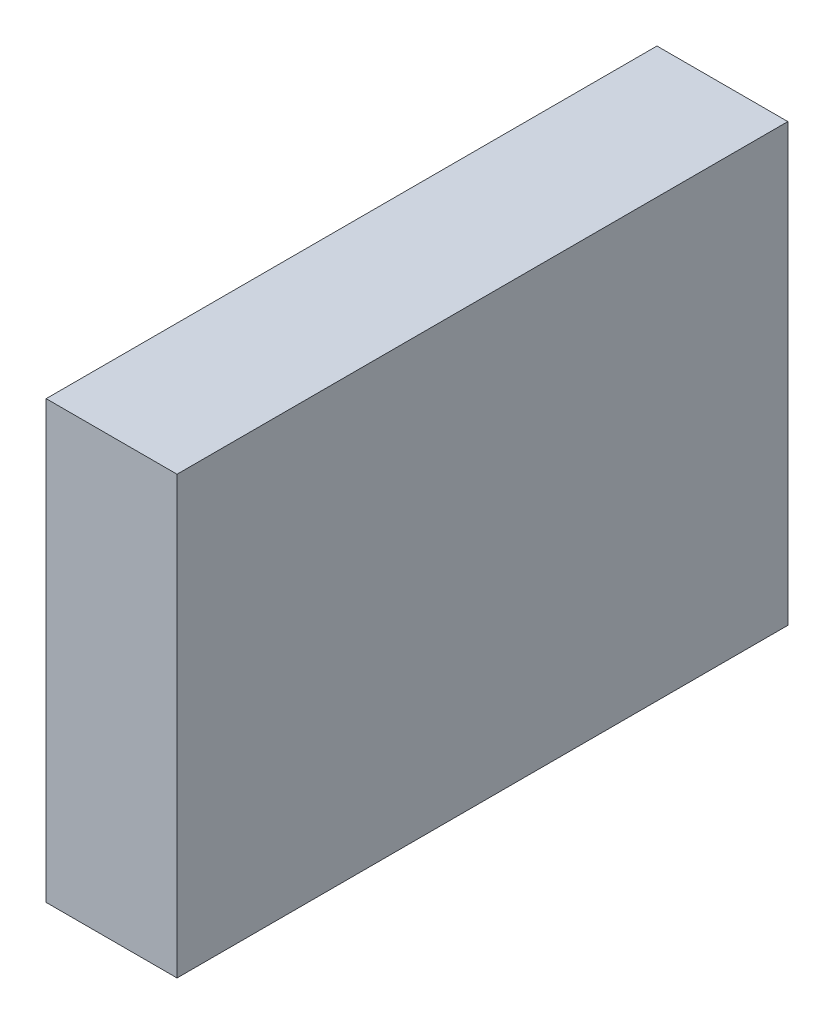
ISO-10303-21;
HEADER;
FILE_DESCRIPTION(('STEP AP214'),'2;1');
FILE_NAME('part.step','',(''),(''),'','','');
FILE_SCHEMA(('AUTOMOTIVE_DESIGN { 1 0 10303 214 1 1 1 1 }'));
ENDSEC;
DATA;
#1=APPLICATION_CONTEXT('core data for automotive mechanical design processes');
#2=APPLICATION_PROTOCOL_DEFINITION('international standard','automotive_design',2000,#1);
#3=PRODUCT_CONTEXT('',#1,'mechanical');
#4=PRODUCT('Part','Part','',(#3));
#5=PRODUCT_RELATED_PRODUCT_CATEGORY('part','',(#4));
#6=PRODUCT_DEFINITION_FORMATION('','',#4);
#7=PRODUCT_DEFINITION_CONTEXT('part definition',#1,'design');
#8=PRODUCT_DEFINITION('design','',#6,#7);
#9=PRODUCT_DEFINITION_SHAPE('','',#8);
#10=(LENGTH_UNIT() NAMED_UNIT(*) SI_UNIT(.MILLI.,.METRE.));
#11=(NAMED_UNIT(*) PLANE_ANGLE_UNIT() SI_UNIT($,.RADIAN.));
#12=(NAMED_UNIT(*) SI_UNIT($,.STERADIAN.) SOLID_ANGLE_UNIT());
#13=UNCERTAINTY_MEASURE_WITH_UNIT(LENGTH_MEASURE(1.E-05),#10,'distance_accuracy_value','');
#14=(GEOMETRIC_REPRESENTATION_CONTEXT(3) GLOBAL_UNCERTAINTY_ASSIGNED_CONTEXT((#13)) GLOBAL_UNIT_ASSIGNED_CONTEXT((#10,
#11,#12)) REPRESENTATION_CONTEXT('',''));
#15=CARTESIAN_POINT('',(0.,0.,0.));
#16=DIRECTION('',(0.,0.,1.));
#17=DIRECTION('',(1.,0.,0.));
#18=AXIS2_PLACEMENT_3D('',#15,#16,#17);
#19=CARTESIAN_POINT('',(3.00000011889499,0.679999652930577,-3.72112158044356));
#20=DIRECTION('',(1.,-1.74845553146952E-07,0.));
#21=DIRECTION('',(1.74845553146952E-07,1.,-8.74227765734759E-08));
#22=AXIS2_PLACEMENT_3D('',#19,#20,#21);
#23=PLANE('',#22);
#24=DIRECTION('',(0.,-8.74227765576152E-08,-0.999999999999996));
#25=VECTOR('',#24,1.);
#26=CARTESIAN_POINT('',(3.00000013113419,0.749999781441059,-2.25112158656315));
#27=LINE('',#26,#25);
#28=CARTESIAN_POINT('',(3.00000013113419,0.749999781441059,-2.25112158656415));
#29=VERTEX_POINT('',#28);
#30=CARTESIAN_POINT('',(3.00000013113418,0.749999659050171,-3.65112158656315));
#31=VERTEX_POINT('',#30);
#32=EDGE_CURVE('E11',#29,#31,#27,.T.);
#33=ORIENTED_EDGE('',*,*,#32,.F.);
#34=DIRECTION('',(-1.74845553146599E-07,-0.999999999999981,8.74227765732993E-08));
#35=VECTOR('',#34,1.);
#36=CARTESIAN_POINT('',(3.00000030597974,1.74999978144306,-2.25112167398593));
#37=LINE('',#36,#35);
#38=CARTESIAN_POINT('',(3.00000030597974,1.74999978144206,-2.25112167398593));
#39=VERTEX_POINT('',#38);
#40=EDGE_CURVE('E59',#39,#29,#37,.T.);
#41=ORIENTED_EDGE('',*,*,#40,.F.);
#42=DIRECTION('',(0.,8.74227766369168E-08,0.999999999999996));
#43=VECTOR('',#42,1.);
#44=CARTESIAN_POINT('',(3.00000030597973,1.74999965905117,-3.65112167398593));
#45=LINE('',#44,#43);
#46=CARTESIAN_POINT('',(3.00000030597973,1.74999965905117,-3.65112167398493));
#47=VERTEX_POINT('',#46);
#48=EDGE_CURVE('E79',#47,#39,#45,.T.);
#49=ORIENTED_EDGE('',*,*,#48,.F.);
#50=DIRECTION('',(1.74845553146599E-07,0.999999999999981,-8.74227765732993E-08));
#51=VECTOR('',#50,1.);
#52=CARTESIAN_POINT('',(3.00000013113418,0.749999659049171,-3.65112158656315));
#53=LINE('',#52,#51);
#54=EDGE_CURVE('E84',#31,#47,#53,.T.);
#55=ORIENTED_EDGE('',*,*,#54,.F.);
#56=EDGE_LOOP('',(#33,#41,#49,#55));
#57=FACE_BOUND('',#56,.T.);
#58=ADVANCED_FACE('F17',(#57),#23,.F.);
#59=CARTESIAN_POINT('',(3.30000011889499,0.679999600476911,-3.72112158044356));
#60=DIRECTION('',(1.,-1.74845553146952E-07,0.));
#61=DIRECTION('',(1.74845553146952E-07,1.,-8.74227765734759E-08));
#62=AXIS2_PLACEMENT_3D('',#59,#60,#61);
#63=PLANE('',#62);
#64=DIRECTION('',(1.74845553146599E-07,0.999999999999981,-8.74227765732994E-08));
#65=VECTOR('',#64,1.);
#66=CARTESIAN_POINT('',(3.30000013113418,0.749999606595506,-3.65112158656315));
#67=LINE('',#66,#65);
#68=CARTESIAN_POINT('',(3.30000013113418,0.749999606596505,-3.65112158656315));
#69=VERTEX_POINT('',#68);
#70=CARTESIAN_POINT('',(3.30000030597973,1.74999960659751,-3.65112167398493));
#71=VERTEX_POINT('',#70);
#72=EDGE_CURVE('E24',#69,#71,#67,.T.);
#73=ORIENTED_EDGE('',*,*,#72,.T.);
#74=DIRECTION('',(0.,8.74227764783136E-08,0.999999999999996));
#75=VECTOR('',#74,1.);
#76=CARTESIAN_POINT('',(3.30000030597973,1.74999960659751,-3.65112167398593));
#77=LINE('',#76,#75);
#78=CARTESIAN_POINT('',(3.30000030597974,1.74999972898839,-2.25112167398593));
#79=VERTEX_POINT('',#78);
#80=EDGE_CURVE('E82',#71,#79,#77,.T.);
#81=ORIENTED_EDGE('',*,*,#80,.T.);
#82=DIRECTION('',(-1.74845553146599E-07,-0.999999999999981,8.74227761292101E-08));
#83=VECTOR('',#82,1.);
#84=CARTESIAN_POINT('',(3.30000030597974,1.74999972898939,-2.25112167398593));
#85=LINE('',#84,#83);
#86=CARTESIAN_POINT('',(3.30000013113419,0.749999728987393,-2.25112158656415));
#87=VERTEX_POINT('',#86);
#88=EDGE_CURVE('E64',#79,#87,#85,.T.);
#89=ORIENTED_EDGE('',*,*,#88,.T.);
#90=DIRECTION('',(0.,-8.74227765576152E-08,-0.999999999999996));
#91=VECTOR('',#90,1.);
#92=CARTESIAN_POINT('',(3.30000013113419,0.749999728987393,-2.25112158656315));
#93=LINE('',#92,#91);
#94=EDGE_CURVE('E61',#87,#69,#93,.T.);
#95=ORIENTED_EDGE('',*,*,#94,.T.);
#96=EDGE_LOOP('',(#73,#81,#89,#95));
#97=FACE_BOUND('',#96,.T.);
#98=ADVANCED_FACE('F62',(#97),#63,.T.);
#99=CARTESIAN_POINT('',(3.00000013113418,0.749999659049171,-3.65112158656315));
#100=DIRECTION('',(0.,-8.74227765734759E-08,-1.));
#101=DIRECTION('',(1.74845553146952E-07,1.,-8.74227765734759E-08));
#102=AXIS2_PLACEMENT_3D('',#99,#100,#101);
#103=PLANE('',#102);
#104=ORIENTED_EDGE('',*,*,#54,.T.);
#105=DIRECTION('',(0.999999999999985,-1.7484555285089E-07,0.));
#106=VECTOR('',#105,1.);
#107=CARTESIAN_POINT('',(3.00000030597973,1.74999965905117,-3.65112167398593));
#108=LINE('',#107,#106);
#109=EDGE_CURVE('E57',#47,#71,#108,.T.);
#110=ORIENTED_EDGE('',*,*,#109,.T.);
#111=ORIENTED_EDGE('',*,*,#72,.F.);
#112=DIRECTION('',(0.999999999999985,-1.74845553220964E-07,0.));
#113=VECTOR('',#112,1.);
#114=CARTESIAN_POINT('',(3.00000013113418,0.749999659049171,-3.65112158656315));
#115=LINE('',#114,#113);
#116=EDGE_CURVE('E55',#31,#69,#115,.T.);
#117=ORIENTED_EDGE('',*,*,#116,.F.);
#118=EDGE_LOOP('',(#104,#110,#111,#117));
#119=FACE_BOUND('',#118,.T.);
#120=ADVANCED_FACE('F53',(#119),#103,.T.);
#121=CARTESIAN_POINT('',(3.00000030597973,1.74999965905117,-3.65112167398593));
#122=DIRECTION('',(1.74845553146952E-07,1.,-8.74227765734759E-08));
#123=DIRECTION('',(0.,8.74227765734759E-08,1.));
#124=AXIS2_PLACEMENT_3D('',#121,#122,#123);
#125=PLANE('',#124);
#126=ORIENTED_EDGE('',*,*,#48,.T.);
#127=DIRECTION('',(0.999999999999985,-1.7484555285089E-07,0.));
#128=VECTOR('',#127,1.);
#129=CARTESIAN_POINT('',(3.00000030597974,1.74999978144306,-2.25112167398593));
#130=LINE('',#129,#128);
#131=EDGE_CURVE('E68',#39,#79,#130,.T.);
#132=ORIENTED_EDGE('',*,*,#131,.T.);
#133=ORIENTED_EDGE('',*,*,#80,.F.);
#134=ORIENTED_EDGE('',*,*,#109,.F.);
#135=EDGE_LOOP('',(#126,#132,#133,#134));
#136=FACE_BOUND('',#135,.T.);
#137=ADVANCED_FACE('F91',(#136),#125,.T.);
#138=CARTESIAN_POINT('',(3.00000030597974,1.74999978144306,-2.25112167398593));
#139=DIRECTION('',(0.,8.74227765734759E-08,1.));
#140=DIRECTION('',(-1.74845553146952E-07,-1.,8.74227765734759E-08));
#141=AXIS2_PLACEMENT_3D('',#138,#139,#140);
#142=PLANE('',#141);
#143=ORIENTED_EDGE('',*,*,#40,.T.);
#144=DIRECTION('',(0.999999999999985,-1.74845553220964E-07,0.));
#145=VECTOR('',#144,1.);
#146=CARTESIAN_POINT('',(3.00000013113419,0.749999781441058,-2.25112158656315));
#147=LINE('',#146,#145);
#148=EDGE_CURVE('E69',#29,#87,#147,.T.);
#149=ORIENTED_EDGE('',*,*,#148,.T.);
#150=ORIENTED_EDGE('',*,*,#88,.F.);
#151=ORIENTED_EDGE('',*,*,#131,.F.);
#152=EDGE_LOOP('',(#143,#149,#150,#151));
#153=FACE_BOUND('',#152,.T.);
#154=ADVANCED_FACE('F88',(#153),#142,.T.);
#155=CARTESIAN_POINT('',(3.00000013113419,0.749999781441059,-2.25112158656315));
#156=DIRECTION('',(-1.74845553146952E-07,-1.,8.74227765734759E-08));
#157=DIRECTION('',(0.,-8.74227765734759E-08,-1.));
#158=AXIS2_PLACEMENT_3D('',#155,#156,#157);
#159=PLANE('',#158);
#160=ORIENTED_EDGE('',*,*,#32,.T.);
#161=ORIENTED_EDGE('',*,*,#116,.T.);
#162=ORIENTED_EDGE('',*,*,#94,.F.);
#163=ORIENTED_EDGE('',*,*,#148,.F.);
#164=EDGE_LOOP('',(#160,#161,#162,#163));
#165=FACE_BOUND('',#164,.T.);
#166=ADVANCED_FACE('F71',(#165),#159,.T.);
#167=CLOSED_SHELL('',(#58,#98,#120,#137,#154,#166));
#168=MANIFOLD_SOLID_BREP('B1',#167);
#169=ADVANCED_BREP_SHAPE_REPRESENTATION('',(#18,#168),#14);
#170=SHAPE_DEFINITION_REPRESENTATION(#9,#169);
ENDSEC;
END-ISO-10303-21;
